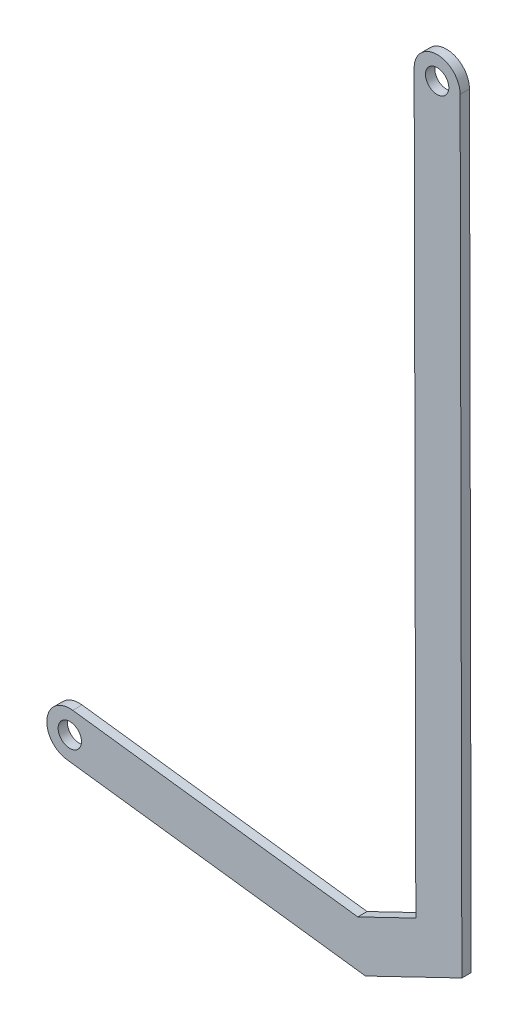
ISO-10303-21;
HEADER;
FILE_DESCRIPTION(('STEP AP214'),'2;1');
FILE_NAME('part.step','',(''),(''),'','','');
FILE_SCHEMA(('AUTOMOTIVE_DESIGN { 1 0 10303 214 1 1 1 1 }'));
ENDSEC;
DATA;
#1=APPLICATION_CONTEXT('core data for automotive mechanical design processes');
#2=APPLICATION_PROTOCOL_DEFINITION('international standard','automotive_design',2000,#1);
#3=PRODUCT_CONTEXT('',#1,'mechanical');
#4=PRODUCT('Part','Part','',(#3));
#5=PRODUCT_RELATED_PRODUCT_CATEGORY('part','',(#4));
#6=PRODUCT_DEFINITION_FORMATION('','',#4);
#7=PRODUCT_DEFINITION_CONTEXT('part definition',#1,'design');
#8=PRODUCT_DEFINITION('design','',#6,#7);
#9=PRODUCT_DEFINITION_SHAPE('','',#8);
#10=(LENGTH_UNIT() NAMED_UNIT(*) SI_UNIT(.MILLI.,.METRE.));
#11=(NAMED_UNIT(*) PLANE_ANGLE_UNIT() SI_UNIT($,.RADIAN.));
#12=(NAMED_UNIT(*) SI_UNIT($,.STERADIAN.) SOLID_ANGLE_UNIT());
#13=UNCERTAINTY_MEASURE_WITH_UNIT(LENGTH_MEASURE(1.E-05),#10,'distance_accuracy_value','');
#14=(GEOMETRIC_REPRESENTATION_CONTEXT(3) GLOBAL_UNCERTAINTY_ASSIGNED_CONTEXT((#13)) GLOBAL_UNIT_ASSIGNED_CONTEXT((#10,
#11,#12)) REPRESENTATION_CONTEXT('',''));
#15=CARTESIAN_POINT('',(0.,0.,0.));
#16=DIRECTION('',(0.,0.,1.));
#17=DIRECTION('',(1.,0.,0.));
#18=AXIS2_PLACEMENT_3D('',#15,#16,#17);
#19=CARTESIAN_POINT('',(0.,0.,2.54));
#20=DIRECTION('',(0.,0.,-1.));
#21=DIRECTION('',(-1.,0.,0.));
#22=AXIS2_PLACEMENT_3D('',#19,#20,#21);
#23=PLANE('',#22);
#24=CARTESIAN_POINT('',(0.,0.,2.54));
#25=DIRECTION('',(0.,0.,1.));
#26=DIRECTION('',(-1.,0.,0.));
#27=AXIS2_PLACEMENT_3D('',#24,#25,#26);
#28=CIRCLE('',#27,6.25998346151846);
#29=CARTESIAN_POINT('',(0.79271351680557,6.20958921497698,2.54));
#30=VERTEX_POINT('',#29);
#31=CARTESIAN_POINT('',(-0.79271351680557,-6.20958921497698,2.54));
#32=VERTEX_POINT('',#31);
#33=EDGE_CURVE('E146',#30,#32,#28,.T.);
#34=ORIENTED_EDGE('',*,*,#33,.T.);
#35=DIRECTION('',(0.991949779603849,-0.126631886757938,0.));
#36=VECTOR('',#35,1.);
#37=CARTESIAN_POINT('',(-0.79271351680557,-6.20958921497698,2.54));
#38=LINE('',#37,#36);
#39=CARTESIAN_POINT('',(80.497230298298,-16.5870288509476,2.54));
#40=VERTEX_POINT('',#39);
#41=EDGE_CURVE('E94',#32,#40,#38,.T.);
#42=ORIENTED_EDGE('',*,*,#41,.T.);
#43=DIRECTION('',(0.900768681368895,0.434299185660003,0.));
#44=VECTOR('',#43,1.);
#45=CARTESIAN_POINT('',(80.497230298298,-16.5870288509476,2.54));
#46=LINE('',#45,#44);
#47=CARTESIAN_POINT('',(106.745951779633,-3.93139527958969,2.54));
#48=VERTEX_POINT('',#47);
#49=EDGE_CURVE('E161',#40,#48,#46,.T.);
#50=ORIENTED_EDGE('',*,*,#49,.T.);
#51=DIRECTION('',(-0.00226603520617708,0.999997432538926,0.));
#52=VECTOR('',#51,1.);
#53=CARTESIAN_POINT('',(106.745951779633,-3.93139527958969,2.54));
#54=LINE('',#53,#52);
#55=CARTESIAN_POINT('',(106.274352445567,204.184578367915,2.54));
#56=VERTEX_POINT('',#55);
#57=EDGE_CURVE('E174',#48,#56,#54,.T.);
#58=ORIENTED_EDGE('',*,*,#57,.T.);
#59=CARTESIAN_POINT('',(100.014368984048,204.184578367915,2.54));
#60=DIRECTION('',(0.,0.,1.));
#61=DIRECTION('',(1.,0.,0.));
#62=AXIS2_PLACEMENT_3D('',#59,#60,#61);
#63=CIRCLE('',#62,6.25998346151846);
#64=CARTESIAN_POINT('',(93.75438552253,204.184578367915,2.54));
#65=VERTEX_POINT('',#64);
#66=EDGE_CURVE('E113',#56,#65,#63,.T.);
#67=ORIENTED_EDGE('',*,*,#66,.T.);
#68=DIRECTION('',(0.00226603520617704,-0.999997432538926,0.));
#69=VECTOR('',#68,1.);
#70=CARTESIAN_POINT('',(94.2081868958844,3.92281411996087,2.54));
#71=LINE('',#70,#69);
#72=CARTESIAN_POINT('',(94.2081868958844,3.92281411996087,2.54));
#73=VERTEX_POINT('',#72);
#74=EDGE_CURVE('E107',#65,#73,#71,.T.);
#75=ORIENTED_EDGE('',*,*,#74,.T.);
#76=DIRECTION('',(-0.900768681368895,-0.434299185660003,0.));
#77=VECTOR('',#76,1.);
#78=CARTESIAN_POINT('',(78.4020766122158,-3.69798905252219,2.54));
#79=LINE('',#78,#77);
#80=CARTESIAN_POINT('',(78.4020766122158,-3.69798905252219,2.54));
#81=VERTEX_POINT('',#80);
#82=EDGE_CURVE('E111',#73,#81,#79,.T.);
#83=ORIENTED_EDGE('',*,*,#82,.T.);
#84=DIRECTION('',(-0.991949779603849,0.126631886757938,0.));
#85=VECTOR('',#84,1.);
#86=CARTESIAN_POINT('',(0.79271351680557,6.20958921497698,2.54));
#87=LINE('',#86,#85);
#88=EDGE_CURVE('E51',#81,#30,#87,.T.);
#89=ORIENTED_EDGE('',*,*,#88,.T.);
#90=EDGE_LOOP('',(#34,#42,#50,#58,#67,#75,#83,#89));
#91=FACE_BOUND('',#90,.T.);
#92=CARTESIAN_POINT('',(0.,0.,2.54));
#93=DIRECTION('',(0.,0.,1.));
#94=DIRECTION('',(1.,0.,0.));
#95=AXIS2_PLACEMENT_3D('',#92,#93,#94);
#96=CIRCLE('',#95,3.175);
#97=CARTESIAN_POINT('',(3.175,0.,2.54));
#98=VERTEX_POINT('',#97);
#99=EDGE_CURVE('E135',#98,#98,#96,.T.);
#100=ORIENTED_EDGE('',*,*,#99,.F.);
#101=EDGE_LOOP('',(#100));
#102=FACE_BOUND('',#101,.T.);
#103=CARTESIAN_POINT('',(100.014368984048,204.184578367915,2.54));
#104=DIRECTION('',(0.,0.,1.));
#105=DIRECTION('',(1.,0.,0.));
#106=AXIS2_PLACEMENT_3D('',#103,#104,#105);
#107=CIRCLE('',#106,3.175);
#108=CARTESIAN_POINT('',(103.189368984048,204.184578367915,2.54));
#109=VERTEX_POINT('',#108);
#110=EDGE_CURVE('E183',#109,#109,#107,.T.);
#111=ORIENTED_EDGE('',*,*,#110,.F.);
#112=EDGE_LOOP('',(#111));
#113=FACE_BOUND('',#112,.T.);
#114=ADVANCED_FACE('F34',(#91,#102,#113),#23,.F.);
#115=CARTESIAN_POINT('',(0.,0.,0.));
#116=DIRECTION('',(0.,0.,-1.));
#117=DIRECTION('',(-1.,0.,0.));
#118=AXIS2_PLACEMENT_3D('',#115,#116,#117);
#119=PLANE('',#118);
#120=CARTESIAN_POINT('',(0.,0.,0.));
#121=DIRECTION('',(0.,0.,1.));
#122=DIRECTION('',(1.,0.,0.));
#123=AXIS2_PLACEMENT_3D('',#120,#121,#122);
#124=CIRCLE('',#123,3.175);
#125=CARTESIAN_POINT('',(3.175,0.,0.));
#126=VERTEX_POINT('',#125);
#127=EDGE_CURVE('E180',#126,#126,#124,.T.);
#128=ORIENTED_EDGE('',*,*,#127,.T.);
#129=EDGE_LOOP('',(#128));
#130=FACE_BOUND('',#129,.T.);
#131=CARTESIAN_POINT('',(0.,0.,0.));
#132=DIRECTION('',(0.,0.,1.));
#133=DIRECTION('',(-1.,0.,0.));
#134=AXIS2_PLACEMENT_3D('',#131,#132,#133);
#135=CIRCLE('',#134,6.25998346151846);
#136=CARTESIAN_POINT('',(0.79271351680557,6.20958921497698,0.));
#137=VERTEX_POINT('',#136);
#138=CARTESIAN_POINT('',(-0.79271351680557,-6.20958921497698,0.));
#139=VERTEX_POINT('',#138);
#140=EDGE_CURVE('E131',#137,#139,#135,.T.);
#141=ORIENTED_EDGE('',*,*,#140,.F.);
#142=DIRECTION('',(-0.991949779603849,0.126631886757938,0.));
#143=VECTOR('',#142,1.);
#144=CARTESIAN_POINT('',(0.79271351680557,6.20958921497698,0.));
#145=LINE('',#144,#143);
#146=CARTESIAN_POINT('',(78.4020766122158,-3.69798905252219,0.));
#147=VERTEX_POINT('',#146);
#148=EDGE_CURVE('E86',#147,#137,#145,.T.);
#149=ORIENTED_EDGE('',*,*,#148,.F.);
#150=DIRECTION('',(-0.900768681368895,-0.434299185660003,0.));
#151=VECTOR('',#150,1.);
#152=CARTESIAN_POINT('',(78.4020766122158,-3.69798905252219,0.));
#153=LINE('',#152,#151);
#154=CARTESIAN_POINT('',(94.2081868958844,3.92281411996087,0.));
#155=VERTEX_POINT('',#154);
#156=EDGE_CURVE('E80',#155,#147,#153,.T.);
#157=ORIENTED_EDGE('',*,*,#156,.F.);
#158=DIRECTION('',(0.00226603520617704,-0.999997432538926,0.));
#159=VECTOR('',#158,1.);
#160=CARTESIAN_POINT('',(94.2081868958844,3.92281411996087,0.));
#161=LINE('',#160,#159);
#162=CARTESIAN_POINT('',(93.75438552253,204.184578367915,0.));
#163=VERTEX_POINT('',#162);
#164=EDGE_CURVE('E121',#163,#155,#161,.T.);
#165=ORIENTED_EDGE('',*,*,#164,.F.);
#166=CARTESIAN_POINT('',(100.014368984048,204.184578367915,0.));
#167=DIRECTION('',(0.,0.,1.));
#168=DIRECTION('',(1.,0.,0.));
#169=AXIS2_PLACEMENT_3D('',#166,#167,#168);
#170=CIRCLE('',#169,6.25998346151846);
#171=CARTESIAN_POINT('',(106.274352445567,204.184578367915,0.));
#172=VERTEX_POINT('',#171);
#173=EDGE_CURVE('E141',#172,#163,#170,.T.);
#174=ORIENTED_EDGE('',*,*,#173,.F.);
#175=DIRECTION('',(-0.00226603520617708,0.999997432538926,0.));
#176=VECTOR('',#175,1.);
#177=CARTESIAN_POINT('',(106.745951779633,-3.93139527958969,0.));
#178=LINE('',#177,#176);
#179=CARTESIAN_POINT('',(106.745951779633,-3.93139527958969,0.));
#180=VERTEX_POINT('',#179);
#181=EDGE_CURVE('E139',#180,#172,#178,.T.);
#182=ORIENTED_EDGE('',*,*,#181,.F.);
#183=DIRECTION('',(0.900768681368895,0.434299185660003,0.));
#184=VECTOR('',#183,1.);
#185=CARTESIAN_POINT('',(80.497230298298,-16.5870288509476,0.));
#186=LINE('',#185,#184);
#187=CARTESIAN_POINT('',(80.497230298298,-16.5870288509476,0.));
#188=VERTEX_POINT('',#187);
#189=EDGE_CURVE('E137',#188,#180,#186,.T.);
#190=ORIENTED_EDGE('',*,*,#189,.F.);
#191=DIRECTION('',(0.991949779603849,-0.126631886757938,0.));
#192=VECTOR('',#191,1.);
#193=CARTESIAN_POINT('',(-0.79271351680557,-6.20958921497698,0.));
#194=LINE('',#193,#192);
#195=EDGE_CURVE('E134',#139,#188,#194,.T.);
#196=ORIENTED_EDGE('',*,*,#195,.F.);
#197=EDGE_LOOP('',(#141,#149,#157,#165,#174,#182,#190,#196));
#198=FACE_BOUND('',#197,.T.);
#199=CARTESIAN_POINT('',(100.014368984048,204.184578367915,0.));
#200=DIRECTION('',(0.,0.,1.));
#201=DIRECTION('',(1.,0.,0.));
#202=AXIS2_PLACEMENT_3D('',#199,#200,#201);
#203=CIRCLE('',#202,3.175);
#204=CARTESIAN_POINT('',(103.189368984048,204.184578367915,0.));
#205=VERTEX_POINT('',#204);
#206=EDGE_CURVE('E186',#205,#205,#203,.T.);
#207=ORIENTED_EDGE('',*,*,#206,.T.);
#208=EDGE_LOOP('',(#207));
#209=FACE_BOUND('',#208,.T.);
#210=ADVANCED_FACE('F165',(#130,#198,#209),#119,.T.);
#211=CARTESIAN_POINT('',(0.,0.,2.54));
#212=DIRECTION('',(0.,0.,-1.));
#213=DIRECTION('',(-1.,0.,0.));
#214=AXIS2_PLACEMENT_3D('',#211,#212,#213);
#215=CYLINDRICAL_SURFACE('',#214,6.25998346151846);
#216=ORIENTED_EDGE('',*,*,#140,.T.);
#217=DIRECTION('',(0.,0.,-1.));
#218=VECTOR('',#217,1.);
#219=CARTESIAN_POINT('',(-0.79271351680557,-6.20958921497698,2.54));
#220=LINE('',#219,#218);
#221=EDGE_CURVE('E11',#32,#139,#220,.T.);
#222=ORIENTED_EDGE('',*,*,#221,.F.);
#223=ORIENTED_EDGE('',*,*,#33,.F.);
#224=DIRECTION('',(0.,0.,-1.));
#225=VECTOR('',#224,1.);
#226=CARTESIAN_POINT('',(0.79271351680557,6.20958921497698,2.54));
#227=LINE('',#226,#225);
#228=EDGE_CURVE('E127',#30,#137,#227,.T.);
#229=ORIENTED_EDGE('',*,*,#228,.T.);
#230=EDGE_LOOP('',(#216,#222,#223,#229));
#231=FACE_BOUND('',#230,.T.);
#232=ADVANCED_FACE('F36',(#231),#215,.T.);
#233=CARTESIAN_POINT('',(-0.79271351680557,-6.20958921497698,2.54));
#234=DIRECTION('',(0.126631886757938,0.991949779603849,0.));
#235=DIRECTION('',(-0.991949779603849,0.126631886757938,0.));
#236=AXIS2_PLACEMENT_3D('',#233,#234,#235);
#237=PLANE('',#236);
#238=ORIENTED_EDGE('',*,*,#195,.T.);
#239=DIRECTION('',(0.,0.,-1.));
#240=VECTOR('',#239,1.);
#241=CARTESIAN_POINT('',(80.497230298298,-16.5870288509476,2.54));
#242=LINE('',#241,#240);
#243=EDGE_CURVE('E43',#40,#188,#242,.T.);
#244=ORIENTED_EDGE('',*,*,#243,.F.);
#245=ORIENTED_EDGE('',*,*,#41,.F.);
#246=ORIENTED_EDGE('',*,*,#221,.T.);
#247=EDGE_LOOP('',(#238,#244,#245,#246));
#248=FACE_BOUND('',#247,.T.);
#249=ADVANCED_FACE('F218',(#248),#237,.F.);
#250=CARTESIAN_POINT('',(80.497230298298,-16.5870288509476,2.54));
#251=DIRECTION('',(-0.434299185660003,0.900768681368895,0.));
#252=DIRECTION('',(-0.900768681368895,-0.434299185660003,0.));
#253=AXIS2_PLACEMENT_3D('',#250,#251,#252);
#254=PLANE('',#253);
#255=ORIENTED_EDGE('',*,*,#189,.T.);
#256=DIRECTION('',(0.,0.,-1.));
#257=VECTOR('',#256,1.);
#258=CARTESIAN_POINT('',(106.745951779633,-3.93139527958969,2.54));
#259=LINE('',#258,#257);
#260=EDGE_CURVE('E153',#48,#180,#259,.T.);
#261=ORIENTED_EDGE('',*,*,#260,.F.);
#262=ORIENTED_EDGE('',*,*,#49,.F.);
#263=ORIENTED_EDGE('',*,*,#243,.T.);
#264=EDGE_LOOP('',(#255,#261,#262,#263));
#265=FACE_BOUND('',#264,.T.);
#266=ADVANCED_FACE('F159',(#265),#254,.F.);
#267=CARTESIAN_POINT('',(106.745951779633,-3.93139527958969,2.54));
#268=DIRECTION('',(-0.999997432538926,-0.00226603520617708,0.));
#269=DIRECTION('',(0.00226603520617708,-0.999997432538926,0.));
#270=AXIS2_PLACEMENT_3D('',#267,#268,#269);
#271=PLANE('',#270);
#272=ORIENTED_EDGE('',*,*,#181,.T.);
#273=DIRECTION('',(0.,0.,-1.));
#274=VECTOR('',#273,1.);
#275=CARTESIAN_POINT('',(106.274352445567,204.184578367915,2.54));
#276=LINE('',#275,#274);
#277=EDGE_CURVE('E150',#56,#172,#276,.T.);
#278=ORIENTED_EDGE('',*,*,#277,.F.);
#279=ORIENTED_EDGE('',*,*,#57,.F.);
#280=ORIENTED_EDGE('',*,*,#260,.T.);
#281=EDGE_LOOP('',(#272,#278,#279,#280));
#282=FACE_BOUND('',#281,.T.);
#283=ADVANCED_FACE('F170',(#282),#271,.F.);
#284=CARTESIAN_POINT('',(100.014368984048,204.184578367915,2.54));
#285=DIRECTION('',(0.,0.,-1.));
#286=DIRECTION('',(-1.,0.,0.));
#287=AXIS2_PLACEMENT_3D('',#284,#285,#286);
#288=CYLINDRICAL_SURFACE('',#287,6.25998346151846);
#289=ORIENTED_EDGE('',*,*,#173,.T.);
#290=DIRECTION('',(0.,0.,-1.));
#291=VECTOR('',#290,1.);
#292=CARTESIAN_POINT('',(93.75438552253,204.184578367915,2.54));
#293=LINE('',#292,#291);
#294=EDGE_CURVE('E122',#65,#163,#293,.T.);
#295=ORIENTED_EDGE('',*,*,#294,.F.);
#296=ORIENTED_EDGE('',*,*,#66,.F.);
#297=ORIENTED_EDGE('',*,*,#277,.T.);
#298=EDGE_LOOP('',(#289,#295,#296,#297));
#299=FACE_BOUND('',#298,.T.);
#300=ADVANCED_FACE('F173',(#299),#288,.T.);
#301=CARTESIAN_POINT('',(94.2081868958844,3.92281411996087,2.54));
#302=DIRECTION('',(0.999997432538926,0.00226603520617704,0.));
#303=DIRECTION('',(-0.00226603520617704,0.999997432538926,0.));
#304=AXIS2_PLACEMENT_3D('',#301,#302,#303);
#305=PLANE('',#304);
#306=ORIENTED_EDGE('',*,*,#164,.T.);
#307=DIRECTION('',(0.,0.,-1.));
#308=VECTOR('',#307,1.);
#309=CARTESIAN_POINT('',(94.2081868958844,3.92281411996087,2.54));
#310=LINE('',#309,#308);
#311=EDGE_CURVE('E118',#73,#155,#310,.T.);
#312=ORIENTED_EDGE('',*,*,#311,.F.);
#313=ORIENTED_EDGE('',*,*,#74,.F.);
#314=ORIENTED_EDGE('',*,*,#294,.T.);
#315=EDGE_LOOP('',(#306,#312,#313,#314));
#316=FACE_BOUND('',#315,.T.);
#317=ADVANCED_FACE('F119',(#316),#305,.F.);
#318=CARTESIAN_POINT('',(78.4020766122158,-3.69798905252219,2.54));
#319=DIRECTION('',(0.434299185660003,-0.900768681368895,0.));
#320=DIRECTION('',(0.900768681368895,0.434299185660003,0.));
#321=AXIS2_PLACEMENT_3D('',#318,#319,#320);
#322=PLANE('',#321);
#323=ORIENTED_EDGE('',*,*,#156,.T.);
#324=DIRECTION('',(0.,0.,-1.));
#325=VECTOR('',#324,1.);
#326=CARTESIAN_POINT('',(78.4020766122158,-3.69798905252219,2.54));
#327=LINE('',#326,#325);
#328=EDGE_CURVE('E123',#81,#147,#327,.T.);
#329=ORIENTED_EDGE('',*,*,#328,.F.);
#330=ORIENTED_EDGE('',*,*,#82,.F.);
#331=ORIENTED_EDGE('',*,*,#311,.T.);
#332=EDGE_LOOP('',(#323,#329,#330,#331));
#333=FACE_BOUND('',#332,.T.);
#334=ADVANCED_FACE('F125',(#333),#322,.F.);
#335=CARTESIAN_POINT('',(0.79271351680557,6.20958921497698,2.54));
#336=DIRECTION('',(-0.126631886757938,-0.991949779603849,0.));
#337=DIRECTION('',(0.991949779603849,-0.126631886757938,0.));
#338=AXIS2_PLACEMENT_3D('',#335,#336,#337);
#339=PLANE('',#338);
#340=ORIENTED_EDGE('',*,*,#148,.T.);
#341=ORIENTED_EDGE('',*,*,#228,.F.);
#342=ORIENTED_EDGE('',*,*,#88,.F.);
#343=ORIENTED_EDGE('',*,*,#328,.T.);
#344=EDGE_LOOP('',(#340,#341,#342,#343));
#345=FACE_BOUND('',#344,.T.);
#346=ADVANCED_FACE('F206',(#345),#339,.F.);
#347=CARTESIAN_POINT('',(0.,0.,2.54));
#348=DIRECTION('',(0.,0.,-1.));
#349=DIRECTION('',(-1.,0.,0.));
#350=AXIS2_PLACEMENT_3D('',#347,#348,#349);
#351=CYLINDRICAL_SURFACE('',#350,3.175);
#352=ORIENTED_EDGE('',*,*,#99,.T.);
#353=EDGE_LOOP('',(#352));
#354=FACE_BOUND('',#353,.T.);
#355=ORIENTED_EDGE('',*,*,#127,.F.);
#356=EDGE_LOOP('',(#355));
#357=FACE_BOUND('',#356,.T.);
#358=ADVANCED_FACE('F203',(#354,#357),#351,.F.);
#359=CARTESIAN_POINT('',(100.014368984048,204.184578367915,2.54));
#360=DIRECTION('',(0.,0.,-1.));
#361=DIRECTION('',(-1.,0.,0.));
#362=AXIS2_PLACEMENT_3D('',#359,#360,#361);
#363=CYLINDRICAL_SURFACE('',#362,3.175);
#364=ORIENTED_EDGE('',*,*,#110,.T.);
#365=EDGE_LOOP('',(#364));
#366=FACE_BOUND('',#365,.T.);
#367=ORIENTED_EDGE('',*,*,#206,.F.);
#368=EDGE_LOOP('',(#367));
#369=FACE_BOUND('',#368,.T.);
#370=ADVANCED_FACE('F192',(#366,#369),#363,.F.);
#371=CLOSED_SHELL('',(#114,#210,#232,#249,#266,#283,#300,#317,#334,#346,#358,#370));
#372=MANIFOLD_SOLID_BREP('B2',#371);
#373=ADVANCED_BREP_SHAPE_REPRESENTATION('',(#18,#372),#14);
#374=SHAPE_DEFINITION_REPRESENTATION(#9,#373);
ENDSEC;
END-ISO-10303-21;
